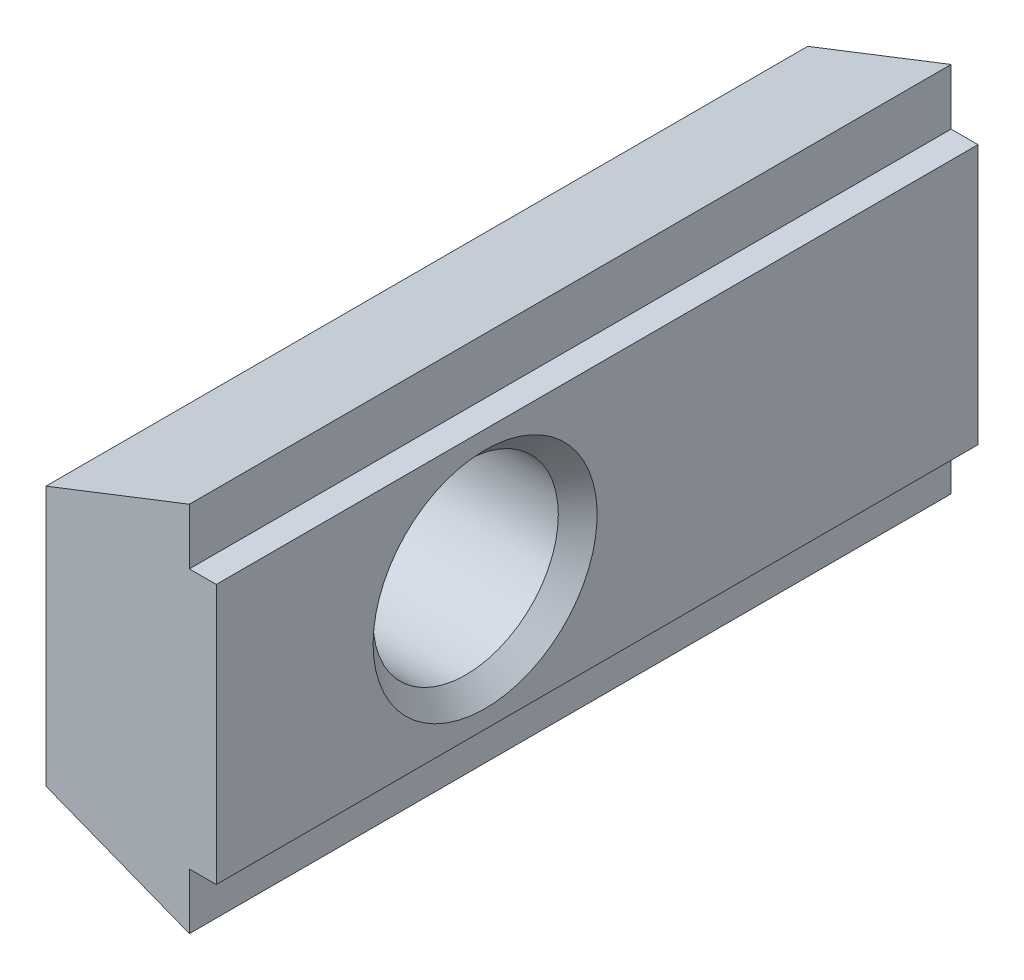
ISO-10303-21;
HEADER;
FILE_DESCRIPTION(('STEP AP214'),'2;1');
FILE_NAME('part.step','',(''),(''),'','','');
FILE_SCHEMA(('AUTOMOTIVE_DESIGN { 1 0 10303 214 1 1 1 1 }'));
ENDSEC;
DATA;
#1=APPLICATION_CONTEXT('core data for automotive mechanical design processes');
#2=APPLICATION_PROTOCOL_DEFINITION('international standard','automotive_design',2000,#1);
#3=PRODUCT_CONTEXT('',#1,'mechanical');
#4=PRODUCT('Part','Part','',(#3));
#5=PRODUCT_RELATED_PRODUCT_CATEGORY('part','',(#4));
#6=PRODUCT_DEFINITION_FORMATION('','',#4);
#7=PRODUCT_DEFINITION_CONTEXT('part definition',#1,'design');
#8=PRODUCT_DEFINITION('design','',#6,#7);
#9=PRODUCT_DEFINITION_SHAPE('','',#8);
#10=(LENGTH_UNIT() NAMED_UNIT(*) SI_UNIT(.MILLI.,.METRE.));
#11=(NAMED_UNIT(*) PLANE_ANGLE_UNIT() SI_UNIT($,.RADIAN.));
#12=(NAMED_UNIT(*) SI_UNIT($,.STERADIAN.) SOLID_ANGLE_UNIT());
#13=UNCERTAINTY_MEASURE_WITH_UNIT(LENGTH_MEASURE(1.E-05),#10,'distance_accuracy_value','');
#14=(GEOMETRIC_REPRESENTATION_CONTEXT(3) GLOBAL_UNCERTAINTY_ASSIGNED_CONTEXT((#13)) GLOBAL_UNIT_ASSIGNED_CONTEXT((#10,
#11,#12)) REPRESENTATION_CONTEXT('',''));
#15=CARTESIAN_POINT('',(0.,0.,0.));
#16=DIRECTION('',(0.,0.,1.));
#17=DIRECTION('',(1.,0.,0.));
#18=AXIS2_PLACEMENT_3D('',#15,#16,#17);
#19=CARTESIAN_POINT('',(0.,2.9,8.5));
#20=DIRECTION('',(1.,0.,0.));
#21=DIRECTION('',(0.,0.,-1.));
#22=AXIS2_PLACEMENT_3D('',#19,#20,#21);
#23=PLANE('',#22);
#24=CARTESIAN_POINT('',(0.,0.,-4.25));
#25=DIRECTION('',(1.,0.,0.));
#26=DIRECTION('',(0.,0.,-1.));
#27=AXIS2_PLACEMENT_3D('',#24,#25,#26);
#28=CIRCLE('',#27,1.6);
#29=CARTESIAN_POINT('',(0.,0.,-5.85));
#30=VERTEX_POINT('',#29);
#31=EDGE_CURVE('E11',#30,#30,#28,.F.);
#32=ORIENTED_EDGE('',*,*,#31,.F.);
#33=EDGE_LOOP('',(#32));
#34=FACE_BOUND('',#33,.T.);
#35=CARTESIAN_POINT('',(0.,0.,2.5));
#36=DIRECTION('',(-1.,0.,0.));
#37=DIRECTION('',(0.,0.,1.));
#38=AXIS2_PLACEMENT_3D('',#35,#36,#37);
#39=CIRCLE('',#38,2.5);
#40=CARTESIAN_POINT('',(0.,0.,5.));
#41=VERTEX_POINT('',#40);
#42=EDGE_CURVE('E118',#41,#41,#39,.T.);
#43=ORIENTED_EDGE('',*,*,#42,.F.);
#44=EDGE_LOOP('',(#43));
#45=FACE_BOUND('',#44,.T.);
#46=DIRECTION('',(0.,0.,-1.));
#47=VECTOR('',#46,1.);
#48=CARTESIAN_POINT('',(0.,2.9,8.5));
#49=LINE('',#48,#47);
#50=CARTESIAN_POINT('',(0.,2.9,8.5));
#51=VERTEX_POINT('',#50);
#52=CARTESIAN_POINT('',(0.,2.9,-8.5));
#53=VERTEX_POINT('',#52);
#54=EDGE_CURVE('E117',#51,#53,#49,.T.);
#55=ORIENTED_EDGE('',*,*,#54,.T.);
#56=DIRECTION('',(0.,-1.,0.));
#57=VECTOR('',#56,1.);
#58=CARTESIAN_POINT('',(0.,2.9,-8.5));
#59=LINE('',#58,#57);
#60=CARTESIAN_POINT('',(0.,-2.9,-8.5));
#61=VERTEX_POINT('',#60);
#62=EDGE_CURVE('E111',#53,#61,#59,.T.);
#63=ORIENTED_EDGE('',*,*,#62,.T.);
#64=DIRECTION('',(0.,0.,-1.));
#65=VECTOR('',#64,1.);
#66=CARTESIAN_POINT('',(0.,-2.9,8.5));
#67=LINE('',#66,#65);
#68=CARTESIAN_POINT('',(0.,-2.9,8.5));
#69=VERTEX_POINT('',#68);
#70=EDGE_CURVE('E40',#69,#61,#67,.T.);
#71=ORIENTED_EDGE('',*,*,#70,.F.);
#72=DIRECTION('',(0.,-1.,0.));
#73=VECTOR('',#72,1.);
#74=CARTESIAN_POINT('',(0.,2.9,8.5));
#75=LINE('',#74,#73);
#76=EDGE_CURVE('E140',#51,#69,#75,.T.);
#77=ORIENTED_EDGE('',*,*,#76,.F.);
#78=EDGE_LOOP('',(#55,#63,#71,#77));
#79=FACE_BOUND('',#78,.T.);
#80=ADVANCED_FACE('F33',(#34,#45,#79),#23,.F.);
#81=CARTESIAN_POINT('',(0.,-2.9,8.5));
#82=DIRECTION('',(0.363850527140476,0.931457349479619,0.));
#83=DIRECTION('',(-0.931457349479619,0.363850527140476,0.));
#84=AXIS2_PLACEMENT_3D('',#81,#82,#83);
#85=PLANE('',#84);
#86=ORIENTED_EDGE('',*,*,#70,.T.);
#87=DIRECTION('',(0.931457349479619,-0.363850527140476,0.));
#88=VECTOR('',#87,1.);
#89=CARTESIAN_POINT('',(0.,-2.9,-8.5));
#90=LINE('',#89,#88);
#91=CARTESIAN_POINT('',(3.2,-4.15,-8.5));
#92=VERTEX_POINT('',#91);
#93=EDGE_CURVE('E100',#61,#92,#90,.T.);
#94=ORIENTED_EDGE('',*,*,#93,.T.);
#95=DIRECTION('',(0.,0.,-1.));
#96=VECTOR('',#95,1.);
#97=CARTESIAN_POINT('',(3.2,-4.15,8.5));
#98=LINE('',#97,#96);
#99=CARTESIAN_POINT('',(3.2,-4.15,8.5));
#100=VERTEX_POINT('',#99);
#101=EDGE_CURVE('E105',#100,#92,#98,.T.);
#102=ORIENTED_EDGE('',*,*,#101,.F.);
#103=DIRECTION('',(0.931457349479619,-0.363850527140476,0.));
#104=VECTOR('',#103,1.);
#105=CARTESIAN_POINT('',(0.,-2.9,8.5));
#106=LINE('',#105,#104);
#107=EDGE_CURVE('E101',#69,#100,#106,.T.);
#108=ORIENTED_EDGE('',*,*,#107,.F.);
#109=EDGE_LOOP('',(#86,#94,#102,#108));
#110=FACE_BOUND('',#109,.T.);
#111=ADVANCED_FACE('F98',(#110),#85,.F.);
#112=CARTESIAN_POINT('',(3.2,-4.15,8.5));
#113=DIRECTION('',(-1.,0.,0.));
#114=DIRECTION('',(0.,0.,1.));
#115=AXIS2_PLACEMENT_3D('',#112,#113,#114);
#116=PLANE('',#115);
#117=ORIENTED_EDGE('',*,*,#101,.T.);
#118=DIRECTION('',(0.,1.,0.));
#119=VECTOR('',#118,1.);
#120=CARTESIAN_POINT('',(3.2,-4.15,-8.5));
#121=LINE('',#120,#119);
#122=CARTESIAN_POINT('',(3.2,-2.9,-8.5));
#123=VERTEX_POINT('',#122);
#124=EDGE_CURVE('E115',#92,#123,#121,.T.);
#125=ORIENTED_EDGE('',*,*,#124,.T.);
#126=DIRECTION('',(0.,0.,-1.));
#127=VECTOR('',#126,1.);
#128=CARTESIAN_POINT('',(3.2,-2.9,8.5));
#129=LINE('',#128,#127);
#130=CARTESIAN_POINT('',(3.2,-2.9,8.5));
#131=VERTEX_POINT('',#130);
#132=EDGE_CURVE('E162',#131,#123,#129,.T.);
#133=ORIENTED_EDGE('',*,*,#132,.F.);
#134=DIRECTION('',(0.,1.,0.));
#135=VECTOR('',#134,1.);
#136=CARTESIAN_POINT('',(3.2,-4.15,8.5));
#137=LINE('',#136,#135);
#138=EDGE_CURVE('E143',#100,#131,#137,.T.);
#139=ORIENTED_EDGE('',*,*,#138,.F.);
#140=EDGE_LOOP('',(#117,#125,#133,#139));
#141=FACE_BOUND('',#140,.T.);
#142=ADVANCED_FACE('F166',(#141),#116,.F.);
#143=CARTESIAN_POINT('',(3.2,-2.9,8.5));
#144=DIRECTION('',(0.,1.,0.));
#145=DIRECTION('',(0.,0.,1.));
#146=AXIS2_PLACEMENT_3D('',#143,#144,#145);
#147=PLANE('',#146);
#148=ORIENTED_EDGE('',*,*,#132,.T.);
#149=DIRECTION('',(1.,0.,0.));
#150=VECTOR('',#149,1.);
#151=CARTESIAN_POINT('',(3.2,-2.9,-8.5));
#152=LINE('',#151,#150);
#153=CARTESIAN_POINT('',(3.8,-2.9,-8.5));
#154=VERTEX_POINT('',#153);
#155=EDGE_CURVE('E126',#123,#154,#152,.T.);
#156=ORIENTED_EDGE('',*,*,#155,.T.);
#157=DIRECTION('',(0.,0.,-1.));
#158=VECTOR('',#157,1.);
#159=CARTESIAN_POINT('',(3.8,-2.9,8.5));
#160=LINE('',#159,#158);
#161=CARTESIAN_POINT('',(3.8,-2.9,8.5));
#162=VERTEX_POINT('',#161);
#163=EDGE_CURVE('E160',#162,#154,#160,.T.);
#164=ORIENTED_EDGE('',*,*,#163,.F.);
#165=DIRECTION('',(1.,0.,0.));
#166=VECTOR('',#165,1.);
#167=CARTESIAN_POINT('',(3.2,-2.9,8.5));
#168=LINE('',#167,#166);
#169=EDGE_CURVE('E145',#131,#162,#168,.T.);
#170=ORIENTED_EDGE('',*,*,#169,.F.);
#171=EDGE_LOOP('',(#148,#156,#164,#170));
#172=FACE_BOUND('',#171,.T.);
#173=ADVANCED_FACE('F174',(#172),#147,.F.);
#174=CARTESIAN_POINT('',(3.8,-2.9,8.5));
#175=DIRECTION('',(-1.,0.,0.));
#176=DIRECTION('',(0.,0.,1.));
#177=AXIS2_PLACEMENT_3D('',#174,#175,#176);
#178=PLANE('',#177);
#179=CARTESIAN_POINT('',(3.8,0.,2.5));
#180=DIRECTION('',(-1.,0.,0.));
#181=DIRECTION('',(0.,0.,1.));
#182=AXIS2_PLACEMENT_3D('',#179,#180,#181);
#183=CIRCLE('',#182,2.5);
#184=CARTESIAN_POINT('',(3.8,0.,5.));
#185=VERTEX_POINT('',#184);
#186=EDGE_CURVE('E215',#185,#185,#183,.T.);
#187=ORIENTED_EDGE('',*,*,#186,.T.);
#188=EDGE_LOOP('',(#187));
#189=FACE_BOUND('',#188,.T.);
#190=ORIENTED_EDGE('',*,*,#163,.T.);
#191=DIRECTION('',(0.,1.,0.));
#192=VECTOR('',#191,1.);
#193=CARTESIAN_POINT('',(3.8,-2.9,-8.5));
#194=LINE('',#193,#192);
#195=CARTESIAN_POINT('',(3.8,2.9,-8.5));
#196=VERTEX_POINT('',#195);
#197=EDGE_CURVE('E129',#154,#196,#194,.T.);
#198=ORIENTED_EDGE('',*,*,#197,.T.);
#199=DIRECTION('',(0.,0.,-1.));
#200=VECTOR('',#199,1.);
#201=CARTESIAN_POINT('',(3.8,2.9,8.5));
#202=LINE('',#201,#200);
#203=CARTESIAN_POINT('',(3.8,2.9,8.5));
#204=VERTEX_POINT('',#203);
#205=EDGE_CURVE('E158',#204,#196,#202,.T.);
#206=ORIENTED_EDGE('',*,*,#205,.F.);
#207=DIRECTION('',(0.,1.,0.));
#208=VECTOR('',#207,1.);
#209=CARTESIAN_POINT('',(3.8,-2.9,8.5));
#210=LINE('',#209,#208);
#211=EDGE_CURVE('E147',#162,#204,#210,.T.);
#212=ORIENTED_EDGE('',*,*,#211,.F.);
#213=EDGE_LOOP('',(#190,#198,#206,#212));
#214=FACE_BOUND('',#213,.T.);
#215=ADVANCED_FACE('F177',(#189,#214),#178,.F.);
#216=CARTESIAN_POINT('',(3.8,2.9,8.5));
#217=DIRECTION('',(0.,-1.,0.));
#218=DIRECTION('',(0.,0.,-1.));
#219=AXIS2_PLACEMENT_3D('',#216,#217,#218);
#220=PLANE('',#219);
#221=ORIENTED_EDGE('',*,*,#205,.T.);
#222=DIRECTION('',(-1.,0.,0.));
#223=VECTOR('',#222,1.);
#224=CARTESIAN_POINT('',(3.8,2.9,-8.5));
#225=LINE('',#224,#223);
#226=CARTESIAN_POINT('',(3.2,2.9,-8.5));
#227=VERTEX_POINT('',#226);
#228=EDGE_CURVE('E132',#196,#227,#225,.T.);
#229=ORIENTED_EDGE('',*,*,#228,.T.);
#230=DIRECTION('',(0.,0.,-1.));
#231=VECTOR('',#230,1.);
#232=CARTESIAN_POINT('',(3.2,2.9,8.5));
#233=LINE('',#232,#231);
#234=CARTESIAN_POINT('',(3.2,2.9,8.5));
#235=VERTEX_POINT('',#234);
#236=EDGE_CURVE('E156',#235,#227,#233,.T.);
#237=ORIENTED_EDGE('',*,*,#236,.F.);
#238=DIRECTION('',(-1.,0.,0.));
#239=VECTOR('',#238,1.);
#240=CARTESIAN_POINT('',(3.8,2.9,8.5));
#241=LINE('',#240,#239);
#242=EDGE_CURVE('E149',#204,#235,#241,.T.);
#243=ORIENTED_EDGE('',*,*,#242,.F.);
#244=EDGE_LOOP('',(#221,#229,#237,#243));
#245=FACE_BOUND('',#244,.T.);
#246=ADVANCED_FACE('F182',(#245),#220,.F.);
#247=CARTESIAN_POINT('',(3.2,2.9,8.5));
#248=DIRECTION('',(-1.,0.,0.));
#249=DIRECTION('',(0.,0.,1.));
#250=AXIS2_PLACEMENT_3D('',#247,#248,#249);
#251=PLANE('',#250);
#252=ORIENTED_EDGE('',*,*,#236,.T.);
#253=DIRECTION('',(0.,1.,0.));
#254=VECTOR('',#253,1.);
#255=CARTESIAN_POINT('',(3.2,2.9,-8.5));
#256=LINE('',#255,#254);
#257=CARTESIAN_POINT('',(3.2,4.15,-8.5));
#258=VERTEX_POINT('',#257);
#259=EDGE_CURVE('E135',#227,#258,#256,.T.);
#260=ORIENTED_EDGE('',*,*,#259,.T.);
#261=DIRECTION('',(0.,0.,-1.));
#262=VECTOR('',#261,1.);
#263=CARTESIAN_POINT('',(3.2,4.15,8.5));
#264=LINE('',#263,#262);
#265=CARTESIAN_POINT('',(3.2,4.15,8.5));
#266=VERTEX_POINT('',#265);
#267=EDGE_CURVE('E154',#266,#258,#264,.T.);
#268=ORIENTED_EDGE('',*,*,#267,.F.);
#269=DIRECTION('',(0.,1.,0.));
#270=VECTOR('',#269,1.);
#271=CARTESIAN_POINT('',(3.2,2.9,8.5));
#272=LINE('',#271,#270);
#273=EDGE_CURVE('E52',#235,#266,#272,.T.);
#274=ORIENTED_EDGE('',*,*,#273,.F.);
#275=EDGE_LOOP('',(#252,#260,#268,#274));
#276=FACE_BOUND('',#275,.T.);
#277=ADVANCED_FACE('F185',(#276),#251,.F.);
#278=CARTESIAN_POINT('',(3.2,4.15,8.5));
#279=DIRECTION('',(0.363850527140476,-0.931457349479619,0.));
#280=DIRECTION('',(0.931457349479619,0.363850527140476,0.));
#281=AXIS2_PLACEMENT_3D('',#278,#279,#280);
#282=PLANE('',#281);
#283=ORIENTED_EDGE('',*,*,#267,.T.);
#284=DIRECTION('',(-0.931457349479619,-0.363850527140476,0.));
#285=VECTOR('',#284,1.);
#286=CARTESIAN_POINT('',(3.2,4.15,-8.5));
#287=LINE('',#286,#285);
#288=EDGE_CURVE('E138',#258,#53,#287,.T.);
#289=ORIENTED_EDGE('',*,*,#288,.T.);
#290=ORIENTED_EDGE('',*,*,#54,.F.);
#291=DIRECTION('',(-0.931457349479619,-0.363850527140476,0.));
#292=VECTOR('',#291,1.);
#293=CARTESIAN_POINT('',(3.2,4.15,8.5));
#294=LINE('',#293,#292);
#295=EDGE_CURVE('E47',#266,#51,#294,.T.);
#296=ORIENTED_EDGE('',*,*,#295,.F.);
#297=EDGE_LOOP('',(#283,#289,#290,#296));
#298=FACE_BOUND('',#297,.T.);
#299=ADVANCED_FACE('F187',(#298),#282,.F.);
#300=CARTESIAN_POINT('',(0.,0.,8.5));
#301=DIRECTION('',(0.,0.,1.));
#302=DIRECTION('',(1.,0.,0.));
#303=AXIS2_PLACEMENT_3D('',#300,#301,#302);
#304=PLANE('',#303);
#305=ORIENTED_EDGE('',*,*,#76,.T.);
#306=ORIENTED_EDGE('',*,*,#107,.T.);
#307=ORIENTED_EDGE('',*,*,#138,.T.);
#308=ORIENTED_EDGE('',*,*,#169,.T.);
#309=ORIENTED_EDGE('',*,*,#211,.T.);
#310=ORIENTED_EDGE('',*,*,#242,.T.);
#311=ORIENTED_EDGE('',*,*,#273,.T.);
#312=ORIENTED_EDGE('',*,*,#295,.T.);
#313=EDGE_LOOP('',(#305,#306,#307,#308,#309,#310,#311,#312));
#314=FACE_BOUND('',#313,.T.);
#315=ADVANCED_FACE('F169',(#314),#304,.T.);
#316=CARTESIAN_POINT('',(0.,0.,-8.5));
#317=DIRECTION('',(0.,0.,1.));
#318=DIRECTION('',(1.,0.,0.));
#319=AXIS2_PLACEMENT_3D('',#316,#317,#318);
#320=PLANE('',#319);
#321=ORIENTED_EDGE('',*,*,#62,.F.);
#322=ORIENTED_EDGE('',*,*,#288,.F.);
#323=ORIENTED_EDGE('',*,*,#259,.F.);
#324=ORIENTED_EDGE('',*,*,#228,.F.);
#325=ORIENTED_EDGE('',*,*,#197,.F.);
#326=ORIENTED_EDGE('',*,*,#155,.F.);
#327=ORIENTED_EDGE('',*,*,#124,.F.);
#328=ORIENTED_EDGE('',*,*,#93,.F.);
#329=EDGE_LOOP('',(#321,#322,#323,#324,#325,#326,#327,#328));
#330=FACE_BOUND('',#329,.T.);
#331=ADVANCED_FACE('F109',(#330),#320,.F.);
#332=CARTESIAN_POINT('',(0.433,0.,2.5));
#333=DIRECTION('',(-1.,0.,0.));
#334=DIRECTION('',(0.,0.,1.));
#335=AXIS2_PLACEMENT_3D('',#332,#333,#334);
#336=CONICAL_SURFACE('',#335,2.067,0.785398163397449);
#337=ORIENTED_EDGE('',*,*,#42,.T.);
#338=EDGE_LOOP('',(#337));
#339=FACE_BOUND('',#338,.T.);
#340=CARTESIAN_POINT('',(0.433,0.,2.5));
#341=DIRECTION('',(-1.,0.,0.));
#342=DIRECTION('',(0.,0.,1.));
#343=AXIS2_PLACEMENT_3D('',#340,#341,#342);
#344=CIRCLE('',#343,2.067);
#345=CARTESIAN_POINT('',(0.433,0.,4.567));
#346=VERTEX_POINT('',#345);
#347=EDGE_CURVE('E121',#346,#346,#344,.T.);
#348=ORIENTED_EDGE('',*,*,#347,.F.);
#349=EDGE_LOOP('',(#348));
#350=FACE_BOUND('',#349,.T.);
#351=ADVANCED_FACE('F205',(#339,#350),#336,.F.);
#352=CARTESIAN_POINT('',(3.8,0.,2.5));
#353=DIRECTION('',(-1.,0.,0.));
#354=DIRECTION('',(0.,0.,1.));
#355=AXIS2_PLACEMENT_3D('',#352,#353,#354);
#356=CYLINDRICAL_SURFACE('',#355,2.067);
#357=ORIENTED_EDGE('',*,*,#347,.T.);
#358=EDGE_LOOP('',(#357));
#359=FACE_BOUND('',#358,.T.);
#360=CARTESIAN_POINT('',(3.367,0.,2.5));
#361=DIRECTION('',(-1.,0.,0.));
#362=DIRECTION('',(0.,0.,1.));
#363=AXIS2_PLACEMENT_3D('',#360,#361,#362);
#364=CIRCLE('',#363,2.067);
#365=CARTESIAN_POINT('',(3.367,0.,4.567));
#366=VERTEX_POINT('',#365);
#367=EDGE_CURVE('E213',#366,#366,#364,.T.);
#368=ORIENTED_EDGE('',*,*,#367,.F.);
#369=EDGE_LOOP('',(#368));
#370=FACE_BOUND('',#369,.T.);
#371=ADVANCED_FACE('F208',(#359,#370),#356,.F.);
#372=CARTESIAN_POINT('',(3.8,0.,2.5));
#373=DIRECTION('',(1.,0.,0.));
#374=DIRECTION('',(0.,0.,-1.));
#375=AXIS2_PLACEMENT_3D('',#372,#373,#374);
#376=CONICAL_SURFACE('',#375,2.5,0.785398163397449);
#377=ORIENTED_EDGE('',*,*,#367,.T.);
#378=EDGE_LOOP('',(#377));
#379=FACE_BOUND('',#378,.T.);
#380=ORIENTED_EDGE('',*,*,#186,.F.);
#381=EDGE_LOOP('',(#380));
#382=FACE_BOUND('',#381,.T.);
#383=ADVANCED_FACE('F222',(#379,#382),#376,.F.);
#384=CARTESIAN_POINT('',(1.2,0.,-4.25));
#385=DIRECTION('',(0.,-1.,0.));
#386=DIRECTION('',(-1.,0.,0.));
#387=AXIS2_PLACEMENT_3D('',#384,#385,#386);
#388=SPHERICAL_SURFACE('',#387,2.);
#389=CARTESIAN_POINT('',(1.2,0.,-4.25));
#390=DIRECTION('',(1.,0.,0.));
#391=DIRECTION('',(0.,0.,-1.));
#392=AXIS2_PLACEMENT_3D('',#389,#390,#391);
#393=SPHERICAL_SURFACE('',#392,2.);
#394=ORIENTED_EDGE('',*,*,#31,.T.);
#395=EDGE_LOOP('',(#394));
#396=FACE_BOUND('',#395,.T.);
#397=ADVANCED_FACE('F224',(#396),#393,.T.);
#398=CLOSED_SHELL('',(#80,#111,#142,#173,#215,#246,#277,#299,#315,#331,#351,#371,#383,#397));
#399=MANIFOLD_SOLID_BREP('B2',#398);
#400=ADVANCED_BREP_SHAPE_REPRESENTATION('',(#18,#399),#14);
#401=SHAPE_DEFINITION_REPRESENTATION(#9,#400);
ENDSEC;
END-ISO-10303-21;
